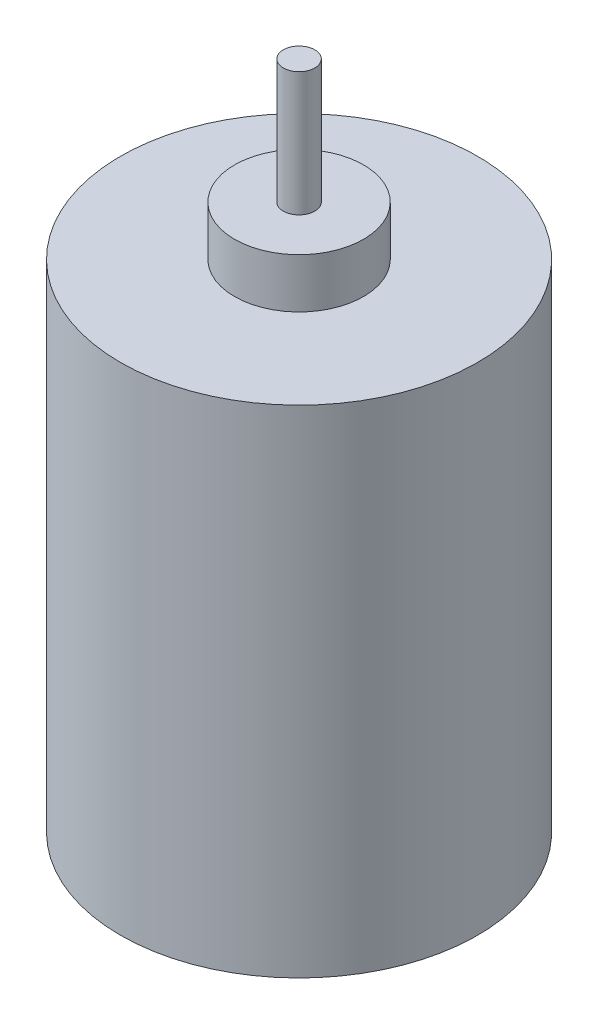
ISO-10303-21;
HEADER;
FILE_DESCRIPTION(('STEP AP214'),'2;1');
FILE_NAME('part.step','',(''),(''),'','','');
FILE_SCHEMA(('AUTOMOTIVE_DESIGN { 1 0 10303 214 1 1 1 1 }'));
ENDSEC;
DATA;
#1=APPLICATION_CONTEXT('core data for automotive mechanical design processes');
#2=APPLICATION_PROTOCOL_DEFINITION('international standard','automotive_design',2000,#1);
#3=PRODUCT_CONTEXT('',#1,'mechanical');
#4=PRODUCT('Part','Part','',(#3));
#5=PRODUCT_RELATED_PRODUCT_CATEGORY('part','',(#4));
#6=PRODUCT_DEFINITION_FORMATION('','',#4);
#7=PRODUCT_DEFINITION_CONTEXT('part definition',#1,'design');
#8=PRODUCT_DEFINITION('design','',#6,#7);
#9=PRODUCT_DEFINITION_SHAPE('','',#8);
#10=(LENGTH_UNIT() NAMED_UNIT(*) SI_UNIT(.MILLI.,.METRE.));
#11=(NAMED_UNIT(*) PLANE_ANGLE_UNIT() SI_UNIT($,.RADIAN.));
#12=(NAMED_UNIT(*) SI_UNIT($,.STERADIAN.) SOLID_ANGLE_UNIT());
#13=UNCERTAINTY_MEASURE_WITH_UNIT(LENGTH_MEASURE(1.E-05),#10,'distance_accuracy_value','');
#14=(GEOMETRIC_REPRESENTATION_CONTEXT(3) GLOBAL_UNCERTAINTY_ASSIGNED_CONTEXT((#13)) GLOBAL_UNIT_ASSIGNED_CONTEXT((#10,
#11,#12)) REPRESENTATION_CONTEXT('',''));
#15=CARTESIAN_POINT('',(0.,0.,0.));
#16=DIRECTION('',(0.,0.,1.));
#17=DIRECTION('',(1.,0.,0.));
#18=AXIS2_PLACEMENT_3D('',#15,#16,#17);
#19=CARTESIAN_POINT('',(0.,50.,0.));
#20=DIRECTION('',(0.,-1.,0.));
#21=DIRECTION('',(0.,0.,-1.));
#22=AXIS2_PLACEMENT_3D('',#19,#20,#21);
#23=CYLINDRICAL_SURFACE('',#22,18.);
#24=CARTESIAN_POINT('',(0.,50.,0.));
#25=DIRECTION('',(0.,1.,0.));
#26=DIRECTION('',(0.,0.,1.));
#27=AXIS2_PLACEMENT_3D('',#24,#25,#26);
#28=CIRCLE('',#27,18.);
#29=CARTESIAN_POINT('',(0.,50.,18.));
#30=VERTEX_POINT('',#29);
#31=EDGE_CURVE('E45',#30,#30,#28,.T.);
#32=ORIENTED_EDGE('',*,*,#31,.F.);
#33=EDGE_LOOP('',(#32));
#34=FACE_BOUND('',#33,.T.);
#35=CARTESIAN_POINT('',(0.,0.,0.));
#36=DIRECTION('',(0.,1.,0.));
#37=DIRECTION('',(0.,0.,1.));
#38=AXIS2_PLACEMENT_3D('',#35,#36,#37);
#39=CIRCLE('',#38,18.);
#40=CARTESIAN_POINT('',(0.,0.,18.));
#41=VERTEX_POINT('',#40);
#42=EDGE_CURVE('E36',#41,#41,#39,.T.);
#43=ORIENTED_EDGE('',*,*,#42,.T.);
#44=EDGE_LOOP('',(#43));
#45=FACE_BOUND('',#44,.T.);
#46=ADVANCED_FACE('F33',(#34,#45),#23,.T.);
#47=CARTESIAN_POINT('',(0.,50.,0.));
#48=DIRECTION('',(0.,1.,0.));
#49=DIRECTION('',(0.,0.,1.));
#50=AXIS2_PLACEMENT_3D('',#47,#48,#49);
#51=PLANE('',#50);
#52=CARTESIAN_POINT('',(0.,50.,0.));
#53=DIRECTION('',(0.,1.,0.));
#54=DIRECTION('',(0.,0.,1.));
#55=AXIS2_PLACEMENT_3D('',#52,#53,#54);
#56=CIRCLE('',#55,6.5);
#57=CARTESIAN_POINT('',(0.,50.,6.5));
#58=VERTEX_POINT('',#57);
#59=EDGE_CURVE('E40',#58,#58,#56,.T.);
#60=ORIENTED_EDGE('',*,*,#59,.F.);
#61=EDGE_LOOP('',(#60));
#62=FACE_BOUND('',#61,.T.);
#63=ORIENTED_EDGE('',*,*,#31,.T.);
#64=EDGE_LOOP('',(#63));
#65=FACE_BOUND('',#64,.T.);
#66=ADVANCED_FACE('F62',(#62,#65),#51,.T.);
#67=CARTESIAN_POINT('',(0.,0.,0.));
#68=DIRECTION('',(0.,1.,0.));
#69=DIRECTION('',(0.,0.,1.));
#70=AXIS2_PLACEMENT_3D('',#67,#68,#69);
#71=PLANE('',#70);
#72=ORIENTED_EDGE('',*,*,#42,.F.);
#73=EDGE_LOOP('',(#72));
#74=FACE_BOUND('',#73,.T.);
#75=ADVANCED_FACE('F59',(#74),#71,.F.);
#76=CARTESIAN_POINT('',(0.,55.,0.));
#77=DIRECTION('',(0.,-1.,0.));
#78=DIRECTION('',(0.,0.,-1.));
#79=AXIS2_PLACEMENT_3D('',#76,#77,#78);
#80=CYLINDRICAL_SURFACE('',#79,6.5);
#81=CARTESIAN_POINT('',(0.,55.,0.));
#82=DIRECTION('',(0.,1.,0.));
#83=DIRECTION('',(0.,0.,1.));
#84=AXIS2_PLACEMENT_3D('',#81,#82,#83);
#85=CIRCLE('',#84,6.5);
#86=CARTESIAN_POINT('',(0.,55.,6.5));
#87=VERTEX_POINT('',#86);
#88=EDGE_CURVE('E50',#87,#87,#85,.T.);
#89=ORIENTED_EDGE('',*,*,#88,.F.);
#90=EDGE_LOOP('',(#89));
#91=FACE_BOUND('',#90,.T.);
#92=ORIENTED_EDGE('',*,*,#59,.T.);
#93=EDGE_LOOP('',(#92));
#94=FACE_BOUND('',#93,.T.);
#95=ADVANCED_FACE('F61',(#91,#94),#80,.T.);
#96=CARTESIAN_POINT('',(0.,55.,0.));
#97=DIRECTION('',(0.,1.,0.));
#98=DIRECTION('',(0.,0.,1.));
#99=AXIS2_PLACEMENT_3D('',#96,#97,#98);
#100=PLANE('',#99);
#101=CARTESIAN_POINT('',(0.,55.,0.));
#102=DIRECTION('',(0.,1.,0.));
#103=DIRECTION('',(0.,0.,1.));
#104=AXIS2_PLACEMENT_3D('',#101,#102,#103);
#105=CIRCLE('',#104,1.5875);
#106=CARTESIAN_POINT('',(0.,55.,1.5875));
#107=VERTEX_POINT('',#106);
#108=EDGE_CURVE('E10',#107,#107,#105,.T.);
#109=ORIENTED_EDGE('',*,*,#108,.F.);
#110=EDGE_LOOP('',(#109));
#111=FACE_BOUND('',#110,.T.);
#112=ORIENTED_EDGE('',*,*,#88,.T.);
#113=EDGE_LOOP('',(#112));
#114=FACE_BOUND('',#113,.T.);
#115=ADVANCED_FACE('F67',(#111,#114),#100,.T.);
#116=CARTESIAN_POINT('',(0.,67.5,0.));
#117=DIRECTION('',(0.,-1.,0.));
#118=DIRECTION('',(0.,0.,-1.));
#119=AXIS2_PLACEMENT_3D('',#116,#117,#118);
#120=CYLINDRICAL_SURFACE('',#119,1.5875);
#121=CARTESIAN_POINT('',(0.,67.5,0.));
#122=DIRECTION('',(0.,1.,0.));
#123=DIRECTION('',(0.,0.,1.));
#124=AXIS2_PLACEMENT_3D('',#121,#122,#123);
#125=CIRCLE('',#124,1.5875);
#126=CARTESIAN_POINT('',(0.,67.5,1.5875));
#127=VERTEX_POINT('',#126);
#128=EDGE_CURVE('E49',#127,#127,#125,.T.);
#129=ORIENTED_EDGE('',*,*,#128,.F.);
#130=EDGE_LOOP('',(#129));
#131=FACE_BOUND('',#130,.T.);
#132=ORIENTED_EDGE('',*,*,#108,.T.);
#133=EDGE_LOOP('',(#132));
#134=FACE_BOUND('',#133,.T.);
#135=ADVANCED_FACE('F97',(#131,#134),#120,.T.);
#136=CARTESIAN_POINT('',(0.,67.5,0.));
#137=DIRECTION('',(0.,1.,0.));
#138=DIRECTION('',(0.,0.,1.));
#139=AXIS2_PLACEMENT_3D('',#136,#137,#138);
#140=PLANE('',#139);
#141=ORIENTED_EDGE('',*,*,#128,.T.);
#142=EDGE_LOOP('',(#141));
#143=FACE_BOUND('',#142,.T.);
#144=ADVANCED_FACE('F107',(#143),#140,.T.);
#145=CLOSED_SHELL('',(#46,#66,#75,#95,#115,#135,#144));
#146=MANIFOLD_SOLID_BREP('B2',#145);
#147=ADVANCED_BREP_SHAPE_REPRESENTATION('',(#18,#146),#14);
#148=SHAPE_DEFINITION_REPRESENTATION(#9,#147);
ENDSEC;
END-ISO-10303-21;
